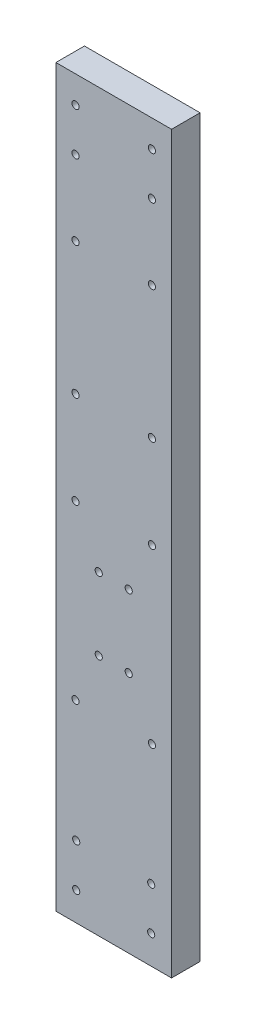
ISO-10303-21;
HEADER;
FILE_DESCRIPTION(('STEP AP214'),'2;1');
FILE_NAME('part.step','',(''),(''),'','','');
FILE_SCHEMA(('AUTOMOTIVE_DESIGN { 1 0 10303 214 1 1 1 1 }'));
ENDSEC;
DATA;
#1=APPLICATION_CONTEXT('core data for automotive mechanical design processes');
#2=APPLICATION_PROTOCOL_DEFINITION('international standard','automotive_design',2000,#1);
#3=PRODUCT_CONTEXT('',#1,'mechanical');
#4=PRODUCT('Part','Part','',(#3));
#5=PRODUCT_RELATED_PRODUCT_CATEGORY('part','',(#4));
#6=PRODUCT_DEFINITION_FORMATION('','',#4);
#7=PRODUCT_DEFINITION_CONTEXT('part definition',#1,'design');
#8=PRODUCT_DEFINITION('design','',#6,#7);
#9=PRODUCT_DEFINITION_SHAPE('','',#8);
#10=(LENGTH_UNIT() NAMED_UNIT(*) SI_UNIT(.MILLI.,.METRE.));
#11=(NAMED_UNIT(*) PLANE_ANGLE_UNIT() SI_UNIT($,.RADIAN.));
#12=(NAMED_UNIT(*) SI_UNIT($,.STERADIAN.) SOLID_ANGLE_UNIT());
#13=UNCERTAINTY_MEASURE_WITH_UNIT(LENGTH_MEASURE(1.E-05),#10,'distance_accuracy_value','');
#14=(GEOMETRIC_REPRESENTATION_CONTEXT(3) GLOBAL_UNCERTAINTY_ASSIGNED_CONTEXT((#13)) GLOBAL_UNIT_ASSIGNED_CONTEXT((#10,
#11,#12)) REPRESENTATION_CONTEXT('',''));
#15=CARTESIAN_POINT('',(0.,0.,0.));
#16=DIRECTION('',(0.,0.,1.));
#17=DIRECTION('',(1.,0.,0.));
#18=AXIS2_PLACEMENT_3D('',#15,#16,#17);
#19=CARTESIAN_POINT('',(0.,0.,4.));
#20=DIRECTION('',(0.,0.,-1.));
#21=DIRECTION('',(-1.,0.,0.));
#22=AXIS2_PLACEMENT_3D('',#19,#20,#21);
#23=PLANE('',#22);
#24=CARTESIAN_POINT('',(13.4499999999989,99.165,4.));
#25=DIRECTION('',(0.,0.,1.));
#26=DIRECTION('',(-1.,0.,0.));
#27=AXIS2_PLACEMENT_3D('',#24,#25,#26);
#28=CIRCLE('',#27,0.499999999999994);
#29=CARTESIAN_POINT('',(12.9499999999989,99.165,4.));
#30=VERTEX_POINT('',#29);
#31=EDGE_CURVE('E218',#30,#30,#28,.T.);
#32=ORIENTED_EDGE('',*,*,#31,.F.);
#33=EDGE_LOOP('',(#32));
#34=FACE_BOUND('',#33,.T.);
#35=CARTESIAN_POINT('',(13.350000000001,10.,4.));
#36=DIRECTION('',(0.,0.,1.));
#37=DIRECTION('',(-1.,0.,0.));
#38=AXIS2_PLACEMENT_3D('',#35,#36,#37);
#39=CIRCLE('',#38,0.499999999999995);
#40=CARTESIAN_POINT('',(12.850000000001,10.,4.));
#41=VERTEX_POINT('',#40);
#42=EDGE_CURVE('E206',#41,#41,#39,.T.);
#43=ORIENTED_EDGE('',*,*,#42,.F.);
#44=EDGE_LOOP('',(#43));
#45=FACE_BOUND('',#44,.T.);
#46=CARTESIAN_POINT('',(2.85,10.,4.));
#47=DIRECTION('',(0.,0.,1.));
#48=DIRECTION('',(1.,0.,0.));
#49=AXIS2_PLACEMENT_3D('',#46,#47,#48);
#50=CIRCLE('',#49,0.499999999999999);
#51=CARTESIAN_POINT('',(3.35,10.,4.));
#52=VERTEX_POINT('',#51);
#53=EDGE_CURVE('E194',#52,#52,#50,.T.);
#54=ORIENTED_EDGE('',*,*,#53,.F.);
#55=EDGE_LOOP('',(#54));
#56=FACE_BOUND('',#55,.T.);
#57=CARTESIAN_POINT('',(13.4499999999999,93.165,4.));
#58=DIRECTION('',(0.,0.,1.));
#59=DIRECTION('',(1.,0.,0.));
#60=AXIS2_PLACEMENT_3D('',#57,#58,#59);
#61=CIRCLE('',#60,0.499999999999994);
#62=CARTESIAN_POINT('',(13.9499999999999,93.165,4.));
#63=VERTEX_POINT('',#62);
#64=EDGE_CURVE('E182',#63,#63,#61,.T.);
#65=ORIENTED_EDGE('',*,*,#64,.F.);
#66=EDGE_LOOP('',(#65));
#67=FACE_BOUND('',#66,.T.);
#68=CARTESIAN_POINT('',(13.4499999999987,82.665,4.));
#69=DIRECTION('',(0.,0.,1.));
#70=DIRECTION('',(1.,0.,0.));
#71=AXIS2_PLACEMENT_3D('',#68,#69,#70);
#72=CIRCLE('',#71,0.499999999999994);
#73=CARTESIAN_POINT('',(13.9499999999987,82.665,4.));
#74=VERTEX_POINT('',#73);
#75=EDGE_CURVE('E170',#74,#74,#72,.T.);
#76=ORIENTED_EDGE('',*,*,#75,.F.);
#77=EDGE_LOOP('',(#76));
#78=FACE_BOUND('',#77,.T.);
#79=CARTESIAN_POINT('',(13.45,27.,4.));
#80=DIRECTION('',(0.,0.,1.));
#81=DIRECTION('',(1.,0.,0.));
#82=AXIS2_PLACEMENT_3D('',#79,#80,#81);
#83=CIRCLE('',#82,0.499999999999993);
#84=CARTESIAN_POINT('',(13.95,27.,4.));
#85=VERTEX_POINT('',#84);
#86=EDGE_CURVE('E158',#85,#85,#83,.T.);
#87=ORIENTED_EDGE('',*,*,#86,.F.);
#88=EDGE_LOOP('',(#87));
#89=FACE_BOUND('',#88,.T.);
#90=CARTESIAN_POINT('',(10.2,34.,4.));
#91=DIRECTION('',(0.,0.,1.));
#92=DIRECTION('',(1.,0.,0.));
#93=AXIS2_PLACEMENT_3D('',#90,#91,#92);
#94=CIRCLE('',#93,0.499999999999999);
#95=CARTESIAN_POINT('',(10.7,34.,4.));
#96=VERTEX_POINT('',#95);
#97=EDGE_CURVE('E146',#96,#96,#94,.T.);
#98=ORIENTED_EDGE('',*,*,#97,.F.);
#99=EDGE_LOOP('',(#98));
#100=FACE_BOUND('',#99,.T.);
#101=CARTESIAN_POINT('',(13.4500000000003,64.14,4.));
#102=DIRECTION('',(0.,0.,1.));
#103=DIRECTION('',(1.,0.,0.));
#104=AXIS2_PLACEMENT_3D('',#101,#102,#103);
#105=CIRCLE('',#104,0.499999999999994);
#106=CARTESIAN_POINT('',(13.9500000000003,64.14,4.));
#107=VERTEX_POINT('',#106);
#108=EDGE_CURVE('E134',#107,#107,#105,.T.);
#109=ORIENTED_EDGE('',*,*,#108,.F.);
#110=EDGE_LOOP('',(#109));
#111=FACE_BOUND('',#110,.T.);
#112=CARTESIAN_POINT('',(13.45,51.14,4.));
#113=DIRECTION('',(0.,0.,1.));
#114=DIRECTION('',(1.,0.,0.));
#115=AXIS2_PLACEMENT_3D('',#112,#113,#114);
#116=CIRCLE('',#115,0.499999999999999);
#117=CARTESIAN_POINT('',(13.95,51.14,4.));
#118=VERTEX_POINT('',#117);
#119=EDGE_CURVE('E122',#118,#118,#116,.T.);
#120=ORIENTED_EDGE('',*,*,#119,.F.);
#121=EDGE_LOOP('',(#120));
#122=FACE_BOUND('',#121,.T.);
#123=CARTESIAN_POINT('',(10.2,44.14,4.));
#124=DIRECTION('',(0.,0.,1.));
#125=DIRECTION('',(1.,0.,0.));
#126=AXIS2_PLACEMENT_3D('',#123,#124,#125);
#127=CIRCLE('',#126,0.499999999999999);
#128=CARTESIAN_POINT('',(10.7,44.14,4.));
#129=VERTEX_POINT('',#128);
#130=EDGE_CURVE('E101',#129,#129,#127,.T.);
#131=ORIENTED_EDGE('',*,*,#130,.F.);
#132=EDGE_LOOP('',(#131));
#133=FACE_BOUND('',#132,.T.);
#134=DIRECTION('',(1.,0.,0.));
#135=VECTOR('',#134,1.);
#136=CARTESIAN_POINT('',(0.,0.,4.));
#137=LINE('',#136,#135);
#138=CARTESIAN_POINT('',(0.,0.,4.));
#139=VERTEX_POINT('',#138);
#140=CARTESIAN_POINT('',(16.2,0.,4.));
#141=VERTEX_POINT('',#140);
#142=EDGE_CURVE('E86',#139,#141,#137,.T.);
#143=ORIENTED_EDGE('',*,*,#142,.T.);
#144=DIRECTION('',(0.,1.,0.));
#145=VECTOR('',#144,1.);
#146=CARTESIAN_POINT('',(16.2,102.96,4.));
#147=LINE('',#146,#145);
#148=CARTESIAN_POINT('',(16.2,102.96,4.));
#149=VERTEX_POINT('',#148);
#150=EDGE_CURVE('E81',#141,#149,#147,.T.);
#151=ORIENTED_EDGE('',*,*,#150,.T.);
#152=DIRECTION('',(-1.,0.,0.));
#153=VECTOR('',#152,1.);
#154=CARTESIAN_POINT('',(0.,102.96,4.));
#155=LINE('',#154,#153);
#156=CARTESIAN_POINT('',(0.,102.96,4.));
#157=VERTEX_POINT('',#156);
#158=EDGE_CURVE('E84',#149,#157,#155,.T.);
#159=ORIENTED_EDGE('',*,*,#158,.T.);
#160=DIRECTION('',(0.,-1.,0.));
#161=VECTOR('',#160,1.);
#162=CARTESIAN_POINT('',(0.,102.96,4.));
#163=LINE('',#162,#161);
#164=EDGE_CURVE('E51',#157,#139,#163,.T.);
#165=ORIENTED_EDGE('',*,*,#164,.T.);
#166=EDGE_LOOP('',(#143,#151,#159,#165));
#167=FACE_BOUND('',#166,.T.);
#168=CARTESIAN_POINT('',(5.99999999999999,44.14,4.));
#169=DIRECTION('',(0.,0.,1.));
#170=DIRECTION('',(1.,0.,0.));
#171=AXIS2_PLACEMENT_3D('',#168,#169,#170);
#172=CIRCLE('',#171,0.500000000000002);
#173=CARTESIAN_POINT('',(6.5,44.14,4.));
#174=VERTEX_POINT('',#173);
#175=EDGE_CURVE('E116',#174,#174,#172,.T.);
#176=ORIENTED_EDGE('',*,*,#175,.F.);
#177=EDGE_LOOP('',(#176));
#178=FACE_BOUND('',#177,.T.);
#179=CARTESIAN_POINT('',(2.74999999999999,51.14,4.));
#180=DIRECTION('',(0.,0.,1.));
#181=DIRECTION('',(1.,0.,0.));
#182=AXIS2_PLACEMENT_3D('',#179,#180,#181);
#183=CIRCLE('',#182,0.499999999999999);
#184=CARTESIAN_POINT('',(3.24999999999999,51.14,4.));
#185=VERTEX_POINT('',#184);
#186=EDGE_CURVE('E128',#185,#185,#183,.T.);
#187=ORIENTED_EDGE('',*,*,#186,.F.);
#188=EDGE_LOOP('',(#187));
#189=FACE_BOUND('',#188,.T.);
#190=CARTESIAN_POINT('',(2.74999999999999,64.14,4.));
#191=DIRECTION('',(0.,0.,1.));
#192=DIRECTION('',(1.,0.,0.));
#193=AXIS2_PLACEMENT_3D('',#190,#191,#192);
#194=CIRCLE('',#193,0.499999999999999);
#195=CARTESIAN_POINT('',(3.24999999999999,64.14,4.));
#196=VERTEX_POINT('',#195);
#197=EDGE_CURVE('E140',#196,#196,#194,.T.);
#198=ORIENTED_EDGE('',*,*,#197,.F.);
#199=EDGE_LOOP('',(#198));
#200=FACE_BOUND('',#199,.T.);
#201=CARTESIAN_POINT('',(6.,34.,4.));
#202=DIRECTION('',(0.,0.,1.));
#203=DIRECTION('',(1.,0.,0.));
#204=AXIS2_PLACEMENT_3D('',#201,#202,#203);
#205=CIRCLE('',#204,0.5);
#206=CARTESIAN_POINT('',(6.5,34.,4.));
#207=VERTEX_POINT('',#206);
#208=EDGE_CURVE('E152',#207,#207,#205,.T.);
#209=ORIENTED_EDGE('',*,*,#208,.F.);
#210=EDGE_LOOP('',(#209));
#211=FACE_BOUND('',#210,.T.);
#212=CARTESIAN_POINT('',(2.75,27.,4.));
#213=DIRECTION('',(0.,0.,1.));
#214=DIRECTION('',(1.,0.,0.));
#215=AXIS2_PLACEMENT_3D('',#212,#213,#214);
#216=CIRCLE('',#215,0.499999999999999);
#217=CARTESIAN_POINT('',(3.25,27.,4.));
#218=VERTEX_POINT('',#217);
#219=EDGE_CURVE('E164',#218,#218,#216,.T.);
#220=ORIENTED_EDGE('',*,*,#219,.F.);
#221=EDGE_LOOP('',(#220));
#222=FACE_BOUND('',#221,.T.);
#223=CARTESIAN_POINT('',(2.74999999999866,82.665,4.));
#224=DIRECTION('',(0.,0.,1.));
#225=DIRECTION('',(1.,0.,0.));
#226=AXIS2_PLACEMENT_3D('',#223,#224,#225);
#227=CIRCLE('',#226,0.499999999999999);
#228=CARTESIAN_POINT('',(3.24999999999866,82.665,4.));
#229=VERTEX_POINT('',#228);
#230=EDGE_CURVE('E176',#229,#229,#227,.T.);
#231=ORIENTED_EDGE('',*,*,#230,.F.);
#232=EDGE_LOOP('',(#231));
#233=FACE_BOUND('',#232,.T.);
#234=CARTESIAN_POINT('',(2.74999999999866,93.165,4.));
#235=DIRECTION('',(0.,0.,1.));
#236=DIRECTION('',(1.,0.,0.));
#237=AXIS2_PLACEMENT_3D('',#234,#235,#236);
#238=CIRCLE('',#237,0.499999999999999);
#239=CARTESIAN_POINT('',(3.24999999999866,93.165,4.));
#240=VERTEX_POINT('',#239);
#241=EDGE_CURVE('E188',#240,#240,#238,.T.);
#242=ORIENTED_EDGE('',*,*,#241,.F.);
#243=EDGE_LOOP('',(#242));
#244=FACE_BOUND('',#243,.T.);
#245=CARTESIAN_POINT('',(2.85,4.,4.));
#246=DIRECTION('',(0.,0.,1.));
#247=DIRECTION('',(1.,0.,0.));
#248=AXIS2_PLACEMENT_3D('',#245,#246,#247);
#249=CIRCLE('',#248,0.499999999999999);
#250=CARTESIAN_POINT('',(3.35,4.,4.));
#251=VERTEX_POINT('',#250);
#252=EDGE_CURVE('E200',#251,#251,#249,.T.);
#253=ORIENTED_EDGE('',*,*,#252,.F.);
#254=EDGE_LOOP('',(#253));
#255=FACE_BOUND('',#254,.T.);
#256=CARTESIAN_POINT('',(13.350000000001,4.,4.));
#257=DIRECTION('',(0.,0.,1.));
#258=DIRECTION('',(-1.,0.,0.));
#259=AXIS2_PLACEMENT_3D('',#256,#257,#258);
#260=CIRCLE('',#259,0.499999999999999);
#261=CARTESIAN_POINT('',(12.850000000001,4.,4.));
#262=VERTEX_POINT('',#261);
#263=EDGE_CURVE('E212',#262,#262,#260,.T.);
#264=ORIENTED_EDGE('',*,*,#263,.F.);
#265=EDGE_LOOP('',(#264));
#266=FACE_BOUND('',#265,.T.);
#267=CARTESIAN_POINT('',(2.74999999999866,99.165,4.));
#268=DIRECTION('',(0.,0.,1.));
#269=DIRECTION('',(-1.,0.,0.));
#270=AXIS2_PLACEMENT_3D('',#267,#268,#269);
#271=CIRCLE('',#270,0.499999999999999);
#272=CARTESIAN_POINT('',(2.24999999999866,99.165,4.));
#273=VERTEX_POINT('',#272);
#274=EDGE_CURVE('E224',#273,#273,#271,.T.);
#275=ORIENTED_EDGE('',*,*,#274,.F.);
#276=EDGE_LOOP('',(#275));
#277=FACE_BOUND('',#276,.T.);
#278=ADVANCED_FACE('F34',(#34,#45,#56,#67,#78,#89,#100,#111,#122,#133,#167,#178,#189,#200,#211,
#222,#233,#244,#255,#266,#277),#23,.F.);
#279=CARTESIAN_POINT('',(0.,0.,0.));
#280=DIRECTION('',(0.,0.,-1.));
#281=DIRECTION('',(-1.,0.,0.));
#282=AXIS2_PLACEMENT_3D('',#279,#280,#281);
#283=PLANE('',#282);
#284=CARTESIAN_POINT('',(13.4499999999989,99.165,0.));
#285=DIRECTION('',(0.,0.,1.));
#286=DIRECTION('',(-1.,0.,0.));
#287=AXIS2_PLACEMENT_3D('',#284,#285,#286);
#288=CIRCLE('',#287,0.499999999999994);
#289=CARTESIAN_POINT('',(12.9499999999989,99.165,0.));
#290=VERTEX_POINT('',#289);
#291=EDGE_CURVE('E221',#290,#290,#288,.T.);
#292=ORIENTED_EDGE('',*,*,#291,.T.);
#293=EDGE_LOOP('',(#292));
#294=FACE_BOUND('',#293,.T.);
#295=CARTESIAN_POINT('',(13.350000000001,10.,0.));
#296=DIRECTION('',(0.,0.,1.));
#297=DIRECTION('',(-1.,0.,0.));
#298=AXIS2_PLACEMENT_3D('',#295,#296,#297);
#299=CIRCLE('',#298,0.499999999999995);
#300=CARTESIAN_POINT('',(12.850000000001,10.,0.));
#301=VERTEX_POINT('',#300);
#302=EDGE_CURVE('E209',#301,#301,#299,.T.);
#303=ORIENTED_EDGE('',*,*,#302,.T.);
#304=EDGE_LOOP('',(#303));
#305=FACE_BOUND('',#304,.T.);
#306=CARTESIAN_POINT('',(2.85,10.,0.));
#307=DIRECTION('',(0.,0.,1.));
#308=DIRECTION('',(1.,0.,0.));
#309=AXIS2_PLACEMENT_3D('',#306,#307,#308);
#310=CIRCLE('',#309,0.499999999999999);
#311=CARTESIAN_POINT('',(3.35,10.,0.));
#312=VERTEX_POINT('',#311);
#313=EDGE_CURVE('E197',#312,#312,#310,.T.);
#314=ORIENTED_EDGE('',*,*,#313,.T.);
#315=EDGE_LOOP('',(#314));
#316=FACE_BOUND('',#315,.T.);
#317=CARTESIAN_POINT('',(13.4499999999999,93.165,0.));
#318=DIRECTION('',(0.,0.,1.));
#319=DIRECTION('',(1.,0.,0.));
#320=AXIS2_PLACEMENT_3D('',#317,#318,#319);
#321=CIRCLE('',#320,0.499999999999994);
#322=CARTESIAN_POINT('',(13.9499999999999,93.165,0.));
#323=VERTEX_POINT('',#322);
#324=EDGE_CURVE('E185',#323,#323,#321,.T.);
#325=ORIENTED_EDGE('',*,*,#324,.T.);
#326=EDGE_LOOP('',(#325));
#327=FACE_BOUND('',#326,.T.);
#328=CARTESIAN_POINT('',(13.4499999999987,82.665,0.));
#329=DIRECTION('',(0.,0.,1.));
#330=DIRECTION('',(1.,0.,0.));
#331=AXIS2_PLACEMENT_3D('',#328,#329,#330);
#332=CIRCLE('',#331,0.499999999999994);
#333=CARTESIAN_POINT('',(13.9499999999987,82.665,0.));
#334=VERTEX_POINT('',#333);
#335=EDGE_CURVE('E173',#334,#334,#332,.T.);
#336=ORIENTED_EDGE('',*,*,#335,.T.);
#337=EDGE_LOOP('',(#336));
#338=FACE_BOUND('',#337,.T.);
#339=CARTESIAN_POINT('',(13.45,27.,0.));
#340=DIRECTION('',(0.,0.,1.));
#341=DIRECTION('',(1.,0.,0.));
#342=AXIS2_PLACEMENT_3D('',#339,#340,#341);
#343=CIRCLE('',#342,0.499999999999993);
#344=CARTESIAN_POINT('',(13.95,27.,0.));
#345=VERTEX_POINT('',#344);
#346=EDGE_CURVE('E161',#345,#345,#343,.T.);
#347=ORIENTED_EDGE('',*,*,#346,.T.);
#348=EDGE_LOOP('',(#347));
#349=FACE_BOUND('',#348,.T.);
#350=CARTESIAN_POINT('',(10.2,34.,0.));
#351=DIRECTION('',(0.,0.,1.));
#352=DIRECTION('',(1.,0.,0.));
#353=AXIS2_PLACEMENT_3D('',#350,#351,#352);
#354=CIRCLE('',#353,0.499999999999999);
#355=CARTESIAN_POINT('',(10.7,34.,0.));
#356=VERTEX_POINT('',#355);
#357=EDGE_CURVE('E149',#356,#356,#354,.T.);
#358=ORIENTED_EDGE('',*,*,#357,.T.);
#359=EDGE_LOOP('',(#358));
#360=FACE_BOUND('',#359,.T.);
#361=CARTESIAN_POINT('',(13.4500000000003,64.14,0.));
#362=DIRECTION('',(0.,0.,1.));
#363=DIRECTION('',(1.,0.,0.));
#364=AXIS2_PLACEMENT_3D('',#361,#362,#363);
#365=CIRCLE('',#364,0.499999999999994);
#366=CARTESIAN_POINT('',(13.9500000000003,64.14,0.));
#367=VERTEX_POINT('',#366);
#368=EDGE_CURVE('E137',#367,#367,#365,.T.);
#369=ORIENTED_EDGE('',*,*,#368,.T.);
#370=EDGE_LOOP('',(#369));
#371=FACE_BOUND('',#370,.T.);
#372=CARTESIAN_POINT('',(13.45,51.14,0.));
#373=DIRECTION('',(0.,0.,1.));
#374=DIRECTION('',(1.,0.,0.));
#375=AXIS2_PLACEMENT_3D('',#372,#373,#374);
#376=CIRCLE('',#375,0.499999999999999);
#377=CARTESIAN_POINT('',(13.95,51.14,0.));
#378=VERTEX_POINT('',#377);
#379=EDGE_CURVE('E125',#378,#378,#376,.T.);
#380=ORIENTED_EDGE('',*,*,#379,.T.);
#381=EDGE_LOOP('',(#380));
#382=FACE_BOUND('',#381,.T.);
#383=CARTESIAN_POINT('',(10.2,44.14,0.));
#384=DIRECTION('',(0.,0.,1.));
#385=DIRECTION('',(1.,0.,0.));
#386=AXIS2_PLACEMENT_3D('',#383,#384,#385);
#387=CIRCLE('',#386,0.499999999999999);
#388=CARTESIAN_POINT('',(10.7,44.14,0.));
#389=VERTEX_POINT('',#388);
#390=EDGE_CURVE('E113',#389,#389,#387,.T.);
#391=ORIENTED_EDGE('',*,*,#390,.T.);
#392=EDGE_LOOP('',(#391));
#393=FACE_BOUND('',#392,.T.);
#394=DIRECTION('',(1.,0.,0.));
#395=VECTOR('',#394,1.);
#396=CARTESIAN_POINT('',(0.,0.,0.));
#397=LINE('',#396,#395);
#398=CARTESIAN_POINT('',(0.,0.,0.));
#399=VERTEX_POINT('',#398);
#400=CARTESIAN_POINT('',(16.2,0.,0.));
#401=VERTEX_POINT('',#400);
#402=EDGE_CURVE('E98',#399,#401,#397,.T.);
#403=ORIENTED_EDGE('',*,*,#402,.F.);
#404=DIRECTION('',(0.,-1.,0.));
#405=VECTOR('',#404,1.);
#406=CARTESIAN_POINT('',(0.,102.96,0.));
#407=LINE('',#406,#405);
#408=CARTESIAN_POINT('',(0.,102.96,0.));
#409=VERTEX_POINT('',#408);
#410=EDGE_CURVE('E74',#409,#399,#407,.T.);
#411=ORIENTED_EDGE('',*,*,#410,.F.);
#412=DIRECTION('',(-1.,0.,0.));
#413=VECTOR('',#412,1.);
#414=CARTESIAN_POINT('',(0.,102.96,0.));
#415=LINE('',#414,#413);
#416=CARTESIAN_POINT('',(16.2,102.96,0.));
#417=VERTEX_POINT('',#416);
#418=EDGE_CURVE('E68',#417,#409,#415,.T.);
#419=ORIENTED_EDGE('',*,*,#418,.F.);
#420=DIRECTION('',(0.,1.,0.));
#421=VECTOR('',#420,1.);
#422=CARTESIAN_POINT('',(16.2,102.96,0.));
#423=LINE('',#422,#421);
#424=EDGE_CURVE('E90',#401,#417,#423,.T.);
#425=ORIENTED_EDGE('',*,*,#424,.F.);
#426=EDGE_LOOP('',(#403,#411,#419,#425));
#427=FACE_BOUND('',#426,.T.);
#428=CARTESIAN_POINT('',(5.99999999999999,44.14,0.));
#429=DIRECTION('',(0.,0.,1.));
#430=DIRECTION('',(1.,0.,0.));
#431=AXIS2_PLACEMENT_3D('',#428,#429,#430);
#432=CIRCLE('',#431,0.500000000000002);
#433=CARTESIAN_POINT('',(6.5,44.14,0.));
#434=VERTEX_POINT('',#433);
#435=EDGE_CURVE('E119',#434,#434,#432,.T.);
#436=ORIENTED_EDGE('',*,*,#435,.T.);
#437=EDGE_LOOP('',(#436));
#438=FACE_BOUND('',#437,.T.);
#439=CARTESIAN_POINT('',(2.74999999999999,51.14,0.));
#440=DIRECTION('',(0.,0.,1.));
#441=DIRECTION('',(1.,0.,0.));
#442=AXIS2_PLACEMENT_3D('',#439,#440,#441);
#443=CIRCLE('',#442,0.499999999999999);
#444=CARTESIAN_POINT('',(3.24999999999999,51.14,0.));
#445=VERTEX_POINT('',#444);
#446=EDGE_CURVE('E131',#445,#445,#443,.T.);
#447=ORIENTED_EDGE('',*,*,#446,.T.);
#448=EDGE_LOOP('',(#447));
#449=FACE_BOUND('',#448,.T.);
#450=CARTESIAN_POINT('',(2.74999999999999,64.14,0.));
#451=DIRECTION('',(0.,0.,1.));
#452=DIRECTION('',(1.,0.,0.));
#453=AXIS2_PLACEMENT_3D('',#450,#451,#452);
#454=CIRCLE('',#453,0.499999999999999);
#455=CARTESIAN_POINT('',(3.24999999999999,64.14,0.));
#456=VERTEX_POINT('',#455);
#457=EDGE_CURVE('E143',#456,#456,#454,.T.);
#458=ORIENTED_EDGE('',*,*,#457,.T.);
#459=EDGE_LOOP('',(#458));
#460=FACE_BOUND('',#459,.T.);
#461=CARTESIAN_POINT('',(6.,34.,0.));
#462=DIRECTION('',(0.,0.,1.));
#463=DIRECTION('',(1.,0.,0.));
#464=AXIS2_PLACEMENT_3D('',#461,#462,#463);
#465=CIRCLE('',#464,0.5);
#466=CARTESIAN_POINT('',(6.5,34.,0.));
#467=VERTEX_POINT('',#466);
#468=EDGE_CURVE('E155',#467,#467,#465,.T.);
#469=ORIENTED_EDGE('',*,*,#468,.T.);
#470=EDGE_LOOP('',(#469));
#471=FACE_BOUND('',#470,.T.);
#472=CARTESIAN_POINT('',(2.75,27.,0.));
#473=DIRECTION('',(0.,0.,1.));
#474=DIRECTION('',(1.,0.,0.));
#475=AXIS2_PLACEMENT_3D('',#472,#473,#474);
#476=CIRCLE('',#475,0.499999999999999);
#477=CARTESIAN_POINT('',(3.25,27.,0.));
#478=VERTEX_POINT('',#477);
#479=EDGE_CURVE('E167',#478,#478,#476,.T.);
#480=ORIENTED_EDGE('',*,*,#479,.T.);
#481=EDGE_LOOP('',(#480));
#482=FACE_BOUND('',#481,.T.);
#483=CARTESIAN_POINT('',(2.74999999999866,82.665,0.));
#484=DIRECTION('',(0.,0.,1.));
#485=DIRECTION('',(1.,0.,0.));
#486=AXIS2_PLACEMENT_3D('',#483,#484,#485);
#487=CIRCLE('',#486,0.499999999999999);
#488=CARTESIAN_POINT('',(3.24999999999866,82.665,0.));
#489=VERTEX_POINT('',#488);
#490=EDGE_CURVE('E179',#489,#489,#487,.T.);
#491=ORIENTED_EDGE('',*,*,#490,.T.);
#492=EDGE_LOOP('',(#491));
#493=FACE_BOUND('',#492,.T.);
#494=CARTESIAN_POINT('',(2.74999999999866,93.165,0.));
#495=DIRECTION('',(0.,0.,1.));
#496=DIRECTION('',(1.,0.,0.));
#497=AXIS2_PLACEMENT_3D('',#494,#495,#496);
#498=CIRCLE('',#497,0.499999999999999);
#499=CARTESIAN_POINT('',(3.24999999999866,93.165,0.));
#500=VERTEX_POINT('',#499);
#501=EDGE_CURVE('E191',#500,#500,#498,.T.);
#502=ORIENTED_EDGE('',*,*,#501,.T.);
#503=EDGE_LOOP('',(#502));
#504=FACE_BOUND('',#503,.T.);
#505=CARTESIAN_POINT('',(2.85,4.,0.));
#506=DIRECTION('',(0.,0.,1.));
#507=DIRECTION('',(1.,0.,0.));
#508=AXIS2_PLACEMENT_3D('',#505,#506,#507);
#509=CIRCLE('',#508,0.499999999999999);
#510=CARTESIAN_POINT('',(3.35,4.,0.));
#511=VERTEX_POINT('',#510);
#512=EDGE_CURVE('E203',#511,#511,#509,.T.);
#513=ORIENTED_EDGE('',*,*,#512,.T.);
#514=EDGE_LOOP('',(#513));
#515=FACE_BOUND('',#514,.T.);
#516=CARTESIAN_POINT('',(13.350000000001,4.,0.));
#517=DIRECTION('',(0.,0.,1.));
#518=DIRECTION('',(-1.,0.,0.));
#519=AXIS2_PLACEMENT_3D('',#516,#517,#518);
#520=CIRCLE('',#519,0.499999999999999);
#521=CARTESIAN_POINT('',(12.850000000001,4.,0.));
#522=VERTEX_POINT('',#521);
#523=EDGE_CURVE('E215',#522,#522,#520,.T.);
#524=ORIENTED_EDGE('',*,*,#523,.T.);
#525=EDGE_LOOP('',(#524));
#526=FACE_BOUND('',#525,.T.);
#527=CARTESIAN_POINT('',(2.74999999999866,99.165,0.));
#528=DIRECTION('',(0.,0.,1.));
#529=DIRECTION('',(-1.,0.,0.));
#530=AXIS2_PLACEMENT_3D('',#527,#528,#529);
#531=CIRCLE('',#530,0.499999999999999);
#532=CARTESIAN_POINT('',(2.24999999999866,99.165,0.));
#533=VERTEX_POINT('',#532);
#534=EDGE_CURVE('E227',#533,#533,#531,.T.);
#535=ORIENTED_EDGE('',*,*,#534,.T.);
#536=EDGE_LOOP('',(#535));
#537=FACE_BOUND('',#536,.T.);
#538=ADVANCED_FACE('F109',(#294,#305,#316,#327,#338,#349,#360,#371,#382,#393,#427,#438,#449,
#460,#471,#482,#493,#504,#515,#526,#537),#283,.T.);
#539=CARTESIAN_POINT('',(0.,0.,4.));
#540=DIRECTION('',(0.,1.,0.));
#541=DIRECTION('',(-1.,0.,0.));
#542=AXIS2_PLACEMENT_3D('',#539,#540,#541);
#543=PLANE('',#542);
#544=ORIENTED_EDGE('',*,*,#402,.T.);
#545=DIRECTION('',(0.,0.,-1.));
#546=VECTOR('',#545,1.);
#547=CARTESIAN_POINT('',(16.2,0.,4.));
#548=LINE('',#547,#546);
#549=EDGE_CURVE('E11',#141,#401,#548,.T.);
#550=ORIENTED_EDGE('',*,*,#549,.F.);
#551=ORIENTED_EDGE('',*,*,#142,.F.);
#552=DIRECTION('',(0.,0.,-1.));
#553=VECTOR('',#552,1.);
#554=CARTESIAN_POINT('',(0.,0.,4.));
#555=LINE('',#554,#553);
#556=EDGE_CURVE('E94',#139,#399,#555,.T.);
#557=ORIENTED_EDGE('',*,*,#556,.T.);
#558=EDGE_LOOP('',(#544,#550,#551,#557));
#559=FACE_BOUND('',#558,.T.);
#560=ADVANCED_FACE('F36',(#559),#543,.F.);
#561=CARTESIAN_POINT('',(16.2,102.96,4.));
#562=DIRECTION('',(-1.,0.,0.));
#563=DIRECTION('',(0.,-1.,0.));
#564=AXIS2_PLACEMENT_3D('',#561,#562,#563);
#565=PLANE('',#564);
#566=ORIENTED_EDGE('',*,*,#424,.T.);
#567=DIRECTION('',(0.,0.,-1.));
#568=VECTOR('',#567,1.);
#569=CARTESIAN_POINT('',(16.2,102.96,4.));
#570=LINE('',#569,#568);
#571=EDGE_CURVE('E43',#149,#417,#570,.T.);
#572=ORIENTED_EDGE('',*,*,#571,.F.);
#573=ORIENTED_EDGE('',*,*,#150,.F.);
#574=ORIENTED_EDGE('',*,*,#549,.T.);
#575=EDGE_LOOP('',(#566,#572,#573,#574));
#576=FACE_BOUND('',#575,.T.);
#577=ADVANCED_FACE('F89',(#576),#565,.F.);
#578=CARTESIAN_POINT('',(0.,102.96,4.));
#579=DIRECTION('',(0.,-1.,0.));
#580=DIRECTION('',(0.,0.,-1.));
#581=AXIS2_PLACEMENT_3D('',#578,#579,#580);
#582=PLANE('',#581);
#583=ORIENTED_EDGE('',*,*,#418,.T.);
#584=DIRECTION('',(0.,0.,-1.));
#585=VECTOR('',#584,1.);
#586=CARTESIAN_POINT('',(0.,102.96,4.));
#587=LINE('',#586,#585);
#588=EDGE_CURVE('E91',#157,#409,#587,.T.);
#589=ORIENTED_EDGE('',*,*,#588,.F.);
#590=ORIENTED_EDGE('',*,*,#158,.F.);
#591=ORIENTED_EDGE('',*,*,#571,.T.);
#592=EDGE_LOOP('',(#583,#589,#590,#591));
#593=FACE_BOUND('',#592,.T.);
#594=ADVANCED_FACE('F92',(#593),#582,.F.);
#595=CARTESIAN_POINT('',(0.,102.96,4.));
#596=DIRECTION('',(1.,0.,0.));
#597=DIRECTION('',(0.,1.,0.));
#598=AXIS2_PLACEMENT_3D('',#595,#596,#597);
#599=PLANE('',#598);
#600=ORIENTED_EDGE('',*,*,#410,.T.);
#601=ORIENTED_EDGE('',*,*,#556,.F.);
#602=ORIENTED_EDGE('',*,*,#164,.F.);
#603=ORIENTED_EDGE('',*,*,#588,.T.);
#604=EDGE_LOOP('',(#600,#601,#602,#603));
#605=FACE_BOUND('',#604,.T.);
#606=ADVANCED_FACE('F106',(#605),#599,.F.);
#607=CARTESIAN_POINT('',(10.2,44.14,4.));
#608=DIRECTION('',(0.,0.,-1.));
#609=DIRECTION('',(-1.,0.,0.));
#610=AXIS2_PLACEMENT_3D('',#607,#608,#609);
#611=CYLINDRICAL_SURFACE('',#610,0.499999999999999);
#612=ORIENTED_EDGE('',*,*,#130,.T.);
#613=EDGE_LOOP('',(#612));
#614=FACE_BOUND('',#613,.T.);
#615=ORIENTED_EDGE('',*,*,#390,.F.);
#616=EDGE_LOOP('',(#615));
#617=FACE_BOUND('',#616,.T.);
#618=ADVANCED_FACE('F247',(#614,#617),#611,.F.);
#619=CARTESIAN_POINT('',(5.99999999999999,44.14,4.));
#620=DIRECTION('',(0.,0.,-1.));
#621=DIRECTION('',(-1.,0.,0.));
#622=AXIS2_PLACEMENT_3D('',#619,#620,#621);
#623=CYLINDRICAL_SURFACE('',#622,0.500000000000002);
#624=ORIENTED_EDGE('',*,*,#175,.T.);
#625=EDGE_LOOP('',(#624));
#626=FACE_BOUND('',#625,.T.);
#627=ORIENTED_EDGE('',*,*,#435,.F.);
#628=EDGE_LOOP('',(#627));
#629=FACE_BOUND('',#628,.T.);
#630=ADVANCED_FACE('F293',(#626,#629),#623,.F.);
#631=CARTESIAN_POINT('',(13.45,51.14,4.));
#632=DIRECTION('',(0.,0.,-1.));
#633=DIRECTION('',(-1.,0.,0.));
#634=AXIS2_PLACEMENT_3D('',#631,#632,#633);
#635=CYLINDRICAL_SURFACE('',#634,0.499999999999999);
#636=ORIENTED_EDGE('',*,*,#119,.T.);
#637=EDGE_LOOP('',(#636));
#638=FACE_BOUND('',#637,.T.);
#639=ORIENTED_EDGE('',*,*,#379,.F.);
#640=EDGE_LOOP('',(#639));
#641=FACE_BOUND('',#640,.T.);
#642=ADVANCED_FACE('F301',(#638,#641),#635,.F.);
#643=CARTESIAN_POINT('',(2.74999999999999,51.14,4.));
#644=DIRECTION('',(0.,0.,-1.));
#645=DIRECTION('',(-1.,0.,0.));
#646=AXIS2_PLACEMENT_3D('',#643,#644,#645);
#647=CYLINDRICAL_SURFACE('',#646,0.499999999999999);
#648=ORIENTED_EDGE('',*,*,#186,.T.);
#649=EDGE_LOOP('',(#648));
#650=FACE_BOUND('',#649,.T.);
#651=ORIENTED_EDGE('',*,*,#446,.F.);
#652=EDGE_LOOP('',(#651));
#653=FACE_BOUND('',#652,.T.);
#654=ADVANCED_FACE('F309',(#650,#653),#647,.F.);
#655=CARTESIAN_POINT('',(13.4500000000003,64.14,4.));
#656=DIRECTION('',(0.,0.,-1.));
#657=DIRECTION('',(-1.,0.,0.));
#658=AXIS2_PLACEMENT_3D('',#655,#656,#657);
#659=CYLINDRICAL_SURFACE('',#658,0.499999999999994);
#660=ORIENTED_EDGE('',*,*,#108,.T.);
#661=EDGE_LOOP('',(#660));
#662=FACE_BOUND('',#661,.T.);
#663=ORIENTED_EDGE('',*,*,#368,.F.);
#664=EDGE_LOOP('',(#663));
#665=FACE_BOUND('',#664,.T.);
#666=ADVANCED_FACE('F318',(#662,#665),#659,.F.);
#667=CARTESIAN_POINT('',(2.74999999999999,64.14,4.));
#668=DIRECTION('',(0.,0.,-1.));
#669=DIRECTION('',(-1.,0.,0.));
#670=AXIS2_PLACEMENT_3D('',#667,#668,#669);
#671=CYLINDRICAL_SURFACE('',#670,0.499999999999999);
#672=ORIENTED_EDGE('',*,*,#197,.T.);
#673=EDGE_LOOP('',(#672));
#674=FACE_BOUND('',#673,.T.);
#675=ORIENTED_EDGE('',*,*,#457,.F.);
#676=EDGE_LOOP('',(#675));
#677=FACE_BOUND('',#676,.T.);
#678=ADVANCED_FACE('F327',(#674,#677),#671,.F.);
#679=CARTESIAN_POINT('',(10.2,34.,4.));
#680=DIRECTION('',(0.,0.,-1.));
#681=DIRECTION('',(-1.,0.,0.));
#682=AXIS2_PLACEMENT_3D('',#679,#680,#681);
#683=CYLINDRICAL_SURFACE('',#682,0.499999999999999);
#684=ORIENTED_EDGE('',*,*,#97,.T.);
#685=EDGE_LOOP('',(#684));
#686=FACE_BOUND('',#685,.T.);
#687=ORIENTED_EDGE('',*,*,#357,.F.);
#688=EDGE_LOOP('',(#687));
#689=FACE_BOUND('',#688,.T.);
#690=ADVANCED_FACE('F336',(#686,#689),#683,.F.);
#691=CARTESIAN_POINT('',(6.,34.,4.));
#692=DIRECTION('',(0.,0.,-1.));
#693=DIRECTION('',(-1.,0.,0.));
#694=AXIS2_PLACEMENT_3D('',#691,#692,#693);
#695=CYLINDRICAL_SURFACE('',#694,0.5);
#696=ORIENTED_EDGE('',*,*,#208,.T.);
#697=EDGE_LOOP('',(#696));
#698=FACE_BOUND('',#697,.T.);
#699=ORIENTED_EDGE('',*,*,#468,.F.);
#700=EDGE_LOOP('',(#699));
#701=FACE_BOUND('',#700,.T.);
#702=ADVANCED_FACE('F345',(#698,#701),#695,.F.);
#703=CARTESIAN_POINT('',(13.45,27.,4.));
#704=DIRECTION('',(0.,0.,-1.));
#705=DIRECTION('',(-1.,0.,0.));
#706=AXIS2_PLACEMENT_3D('',#703,#704,#705);
#707=CYLINDRICAL_SURFACE('',#706,0.499999999999993);
#708=ORIENTED_EDGE('',*,*,#86,.T.);
#709=EDGE_LOOP('',(#708));
#710=FACE_BOUND('',#709,.T.);
#711=ORIENTED_EDGE('',*,*,#346,.F.);
#712=EDGE_LOOP('',(#711));
#713=FACE_BOUND('',#712,.T.);
#714=ADVANCED_FACE('F354',(#710,#713),#707,.F.);
#715=CARTESIAN_POINT('',(2.75,27.,4.));
#716=DIRECTION('',(0.,0.,-1.));
#717=DIRECTION('',(-1.,0.,0.));
#718=AXIS2_PLACEMENT_3D('',#715,#716,#717);
#719=CYLINDRICAL_SURFACE('',#718,0.499999999999999);
#720=ORIENTED_EDGE('',*,*,#219,.T.);
#721=EDGE_LOOP('',(#720));
#722=FACE_BOUND('',#721,.T.);
#723=ORIENTED_EDGE('',*,*,#479,.F.);
#724=EDGE_LOOP('',(#723));
#725=FACE_BOUND('',#724,.T.);
#726=ADVANCED_FACE('F363',(#722,#725),#719,.F.);
#727=CARTESIAN_POINT('',(13.4499999999987,82.665,4.));
#728=DIRECTION('',(0.,0.,-1.));
#729=DIRECTION('',(-1.,0.,0.));
#730=AXIS2_PLACEMENT_3D('',#727,#728,#729);
#731=CYLINDRICAL_SURFACE('',#730,0.499999999999994);
#732=ORIENTED_EDGE('',*,*,#75,.T.);
#733=EDGE_LOOP('',(#732));
#734=FACE_BOUND('',#733,.T.);
#735=ORIENTED_EDGE('',*,*,#335,.F.);
#736=EDGE_LOOP('',(#735));
#737=FACE_BOUND('',#736,.T.);
#738=ADVANCED_FACE('F372',(#734,#737),#731,.F.);
#739=CARTESIAN_POINT('',(2.74999999999866,82.665,4.));
#740=DIRECTION('',(0.,0.,-1.));
#741=DIRECTION('',(-1.,0.,0.));
#742=AXIS2_PLACEMENT_3D('',#739,#740,#741);
#743=CYLINDRICAL_SURFACE('',#742,0.499999999999999);
#744=ORIENTED_EDGE('',*,*,#230,.T.);
#745=EDGE_LOOP('',(#744));
#746=FACE_BOUND('',#745,.T.);
#747=ORIENTED_EDGE('',*,*,#490,.F.);
#748=EDGE_LOOP('',(#747));
#749=FACE_BOUND('',#748,.T.);
#750=ADVANCED_FACE('F381',(#746,#749),#743,.F.);
#751=CARTESIAN_POINT('',(13.4499999999999,93.165,4.));
#752=DIRECTION('',(0.,0.,-1.));
#753=DIRECTION('',(-1.,0.,0.));
#754=AXIS2_PLACEMENT_3D('',#751,#752,#753);
#755=CYLINDRICAL_SURFACE('',#754,0.499999999999994);
#756=ORIENTED_EDGE('',*,*,#64,.T.);
#757=EDGE_LOOP('',(#756));
#758=FACE_BOUND('',#757,.T.);
#759=ORIENTED_EDGE('',*,*,#324,.F.);
#760=EDGE_LOOP('',(#759));
#761=FACE_BOUND('',#760,.T.);
#762=ADVANCED_FACE('F390',(#758,#761),#755,.F.);
#763=CARTESIAN_POINT('',(2.74999999999866,93.165,4.));
#764=DIRECTION('',(0.,0.,-1.));
#765=DIRECTION('',(-1.,0.,0.));
#766=AXIS2_PLACEMENT_3D('',#763,#764,#765);
#767=CYLINDRICAL_SURFACE('',#766,0.499999999999999);
#768=ORIENTED_EDGE('',*,*,#241,.T.);
#769=EDGE_LOOP('',(#768));
#770=FACE_BOUND('',#769,.T.);
#771=ORIENTED_EDGE('',*,*,#501,.F.);
#772=EDGE_LOOP('',(#771));
#773=FACE_BOUND('',#772,.T.);
#774=ADVANCED_FACE('F399',(#770,#773),#767,.F.);
#775=CARTESIAN_POINT('',(2.85,10.,4.));
#776=DIRECTION('',(0.,0.,-1.));
#777=DIRECTION('',(-1.,0.,0.));
#778=AXIS2_PLACEMENT_3D('',#775,#776,#777);
#779=CYLINDRICAL_SURFACE('',#778,0.499999999999999);
#780=ORIENTED_EDGE('',*,*,#53,.T.);
#781=EDGE_LOOP('',(#780));
#782=FACE_BOUND('',#781,.T.);
#783=ORIENTED_EDGE('',*,*,#313,.F.);
#784=EDGE_LOOP('',(#783));
#785=FACE_BOUND('',#784,.T.);
#786=ADVANCED_FACE('F408',(#782,#785),#779,.F.);
#787=CARTESIAN_POINT('',(2.85,4.,4.));
#788=DIRECTION('',(0.,0.,-1.));
#789=DIRECTION('',(-1.,0.,0.));
#790=AXIS2_PLACEMENT_3D('',#787,#788,#789);
#791=CYLINDRICAL_SURFACE('',#790,0.499999999999999);
#792=ORIENTED_EDGE('',*,*,#252,.T.);
#793=EDGE_LOOP('',(#792));
#794=FACE_BOUND('',#793,.T.);
#795=ORIENTED_EDGE('',*,*,#512,.F.);
#796=EDGE_LOOP('',(#795));
#797=FACE_BOUND('',#796,.T.);
#798=ADVANCED_FACE('F417',(#794,#797),#791,.F.);
#799=CARTESIAN_POINT('',(13.350000000001,10.,4.));
#800=DIRECTION('',(0.,0.,-1.));
#801=DIRECTION('',(-1.,0.,0.));
#802=AXIS2_PLACEMENT_3D('',#799,#800,#801);
#803=CYLINDRICAL_SURFACE('',#802,0.499999999999995);
#804=ORIENTED_EDGE('',*,*,#42,.T.);
#805=EDGE_LOOP('',(#804));
#806=FACE_BOUND('',#805,.T.);
#807=ORIENTED_EDGE('',*,*,#302,.F.);
#808=EDGE_LOOP('',(#807));
#809=FACE_BOUND('',#808,.T.);
#810=ADVANCED_FACE('F426',(#806,#809),#803,.F.);
#811=CARTESIAN_POINT('',(13.350000000001,4.,4.));
#812=DIRECTION('',(0.,0.,-1.));
#813=DIRECTION('',(-1.,0.,0.));
#814=AXIS2_PLACEMENT_3D('',#811,#812,#813);
#815=CYLINDRICAL_SURFACE('',#814,0.499999999999999);
#816=ORIENTED_EDGE('',*,*,#263,.T.);
#817=EDGE_LOOP('',(#816));
#818=FACE_BOUND('',#817,.T.);
#819=ORIENTED_EDGE('',*,*,#523,.F.);
#820=EDGE_LOOP('',(#819));
#821=FACE_BOUND('',#820,.T.);
#822=ADVANCED_FACE('F435',(#818,#821),#815,.F.);
#823=CARTESIAN_POINT('',(13.4499999999989,99.165,4.));
#824=DIRECTION('',(0.,0.,-1.));
#825=DIRECTION('',(-1.,0.,0.));
#826=AXIS2_PLACEMENT_3D('',#823,#824,#825);
#827=CYLINDRICAL_SURFACE('',#826,0.499999999999994);
#828=ORIENTED_EDGE('',*,*,#31,.T.);
#829=EDGE_LOOP('',(#828));
#830=FACE_BOUND('',#829,.T.);
#831=ORIENTED_EDGE('',*,*,#291,.F.);
#832=EDGE_LOOP('',(#831));
#833=FACE_BOUND('',#832,.T.);
#834=ADVANCED_FACE('F444',(#830,#833),#827,.F.);
#835=CARTESIAN_POINT('',(2.74999999999866,99.165,4.));
#836=DIRECTION('',(0.,0.,-1.));
#837=DIRECTION('',(-1.,0.,0.));
#838=AXIS2_PLACEMENT_3D('',#835,#836,#837);
#839=CYLINDRICAL_SURFACE('',#838,0.499999999999999);
#840=ORIENTED_EDGE('',*,*,#274,.T.);
#841=EDGE_LOOP('',(#840));
#842=FACE_BOUND('',#841,.T.);
#843=ORIENTED_EDGE('',*,*,#534,.F.);
#844=EDGE_LOOP('',(#843));
#845=FACE_BOUND('',#844,.T.);
#846=ADVANCED_FACE('F233',(#842,#845),#839,.F.);
#847=CLOSED_SHELL('',(#278,#538,#560,#577,#594,#606,#618,#630,#642,#654,#666,#678,#690,#702,
#714,#726,#738,#750,#762,#774,#786,#798,#810,#822,#834,#846));
#848=MANIFOLD_SOLID_BREP('B2',#847);
#849=ADVANCED_BREP_SHAPE_REPRESENTATION('',(#18,#848),#14);
#850=SHAPE_DEFINITION_REPRESENTATION(#9,#849);
ENDSEC;
END-ISO-10303-21;
